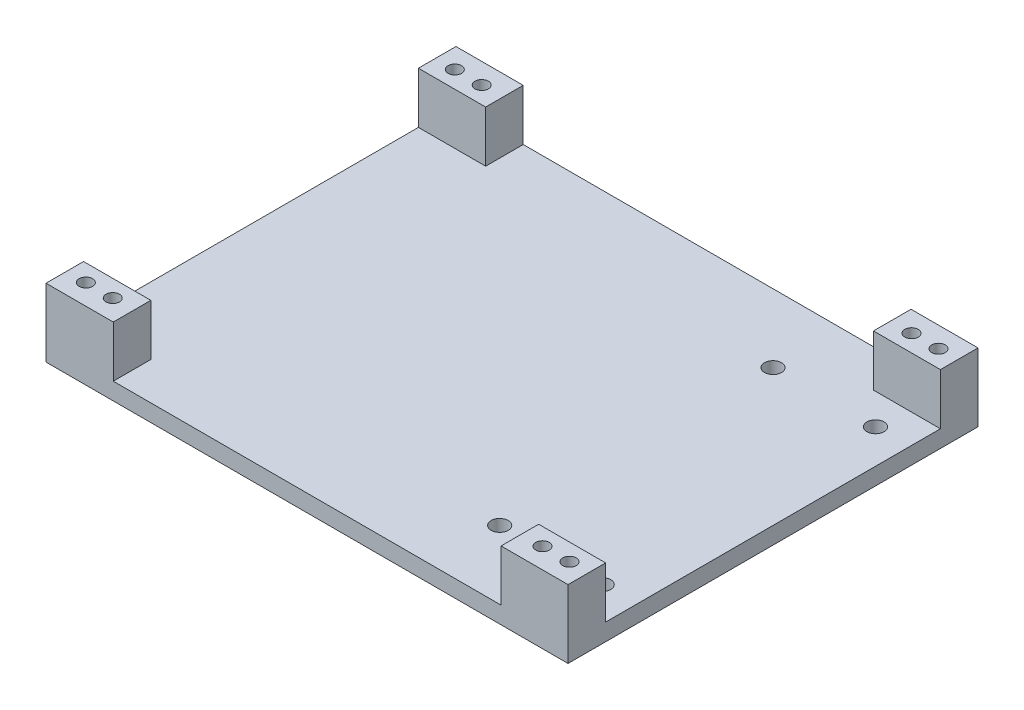
ISO-10303-21;
HEADER;
FILE_DESCRIPTION(('STEP AP214'),'2;1');
FILE_NAME('part.step','',(''),(''),'','','');
FILE_SCHEMA(('AUTOMOTIVE_DESIGN { 1 0 10303 214 1 1 1 1 }'));
ENDSEC;
DATA;
#1=APPLICATION_CONTEXT('core data for automotive mechanical design processes');
#2=APPLICATION_PROTOCOL_DEFINITION('international standard','automotive_design',2000,#1);
#3=PRODUCT_CONTEXT('',#1,'mechanical');
#4=PRODUCT('Part','Part','',(#3));
#5=PRODUCT_RELATED_PRODUCT_CATEGORY('part','',(#4));
#6=PRODUCT_DEFINITION_FORMATION('','',#4);
#7=PRODUCT_DEFINITION_CONTEXT('part definition',#1,'design');
#8=PRODUCT_DEFINITION('design','',#6,#7);
#9=PRODUCT_DEFINITION_SHAPE('','',#8);
#10=(LENGTH_UNIT() NAMED_UNIT(*) SI_UNIT(.MILLI.,.METRE.));
#11=(NAMED_UNIT(*) PLANE_ANGLE_UNIT() SI_UNIT($,.RADIAN.));
#12=(NAMED_UNIT(*) SI_UNIT($,.STERADIAN.) SOLID_ANGLE_UNIT());
#13=UNCERTAINTY_MEASURE_WITH_UNIT(LENGTH_MEASURE(1.E-05),#10,'distance_accuracy_value','');
#14=(GEOMETRIC_REPRESENTATION_CONTEXT(3) GLOBAL_UNCERTAINTY_ASSIGNED_CONTEXT((#13)) GLOBAL_UNIT_ASSIGNED_CONTEXT((#10,
#11,#12)) REPRESENTATION_CONTEXT('',''));
#15=CARTESIAN_POINT('',(0.,0.,0.));
#16=DIRECTION('',(0.,0.,1.));
#17=DIRECTION('',(1.,0.,0.));
#18=AXIS2_PLACEMENT_3D('',#15,#16,#17);
#19=CARTESIAN_POINT('',(0.,6.35,0.));
#20=DIRECTION('',(0.,1.,0.));
#21=DIRECTION('',(0.,0.,1.));
#22=AXIS2_PLACEMENT_3D('',#19,#20,#21);
#23=PLANE('',#22);
#24=CARTESIAN_POINT('',(40.64,6.35,70.4144444444444));
#25=DIRECTION('',(0.,1.,0.));
#26=DIRECTION('',(0.,0.,1.));
#27=AXIS2_PLACEMENT_3D('',#24,#25,#26);
#28=CIRCLE('',#27,3.175);
#29=CARTESIAN_POINT('',(40.64,6.35,73.5894444444444));
#30=VERTEX_POINT('',#29);
#31=EDGE_CURVE('E260',#30,#30,#28,.T.);
#32=ORIENTED_EDGE('',*,*,#31,.F.);
#33=EDGE_LOOP('',(#32));
#34=FACE_BOUND('',#33,.T.);
#35=CARTESIAN_POINT('',(40.64,6.35,-31.1855555555556));
#36=DIRECTION('',(0.,1.,0.));
#37=DIRECTION('',(0.,0.,1.));
#38=AXIS2_PLACEMENT_3D('',#35,#36,#37);
#39=CIRCLE('',#38,3.175);
#40=CARTESIAN_POINT('',(40.64,6.35,-28.0105555555556));
#41=VERTEX_POINT('',#40);
#42=EDGE_CURVE('E271',#41,#41,#39,.T.);
#43=ORIENTED_EDGE('',*,*,#42,.F.);
#44=EDGE_LOOP('',(#43));
#45=FACE_BOUND('',#44,.T.);
#46=CARTESIAN_POINT('',(2.54000000000001,6.35,-31.1855555555556));
#47=DIRECTION('',(0.,1.,0.));
#48=DIRECTION('',(0.,0.,1.));
#49=AXIS2_PLACEMENT_3D('',#46,#47,#48);
#50=CIRCLE('',#49,3.175);
#51=CARTESIAN_POINT('',(2.54000000000001,6.35,-28.0105555555556));
#52=VERTEX_POINT('',#51);
#53=EDGE_CURVE('E265',#52,#52,#50,.T.);
#54=ORIENTED_EDGE('',*,*,#53,.F.);
#55=EDGE_LOOP('',(#54));
#56=FACE_BOUND('',#55,.T.);
#57=CARTESIAN_POINT('',(2.54000000000001,6.35,70.4144444444444));
#58=DIRECTION('',(0.,1.,0.));
#59=DIRECTION('',(0.,0.,1.));
#60=AXIS2_PLACEMENT_3D('',#57,#58,#59);
#61=CIRCLE('',#60,3.175);
#62=CARTESIAN_POINT('',(2.54000000000001,6.35,73.5894444444444));
#63=VERTEX_POINT('',#62);
#64=EDGE_CURVE('E264',#63,#63,#61,.T.);
#65=ORIENTED_EDGE('',*,*,#64,.F.);
#66=EDGE_LOOP('',(#65));
#67=FACE_BOUND('',#66,.T.);
#68=DIRECTION('',(1.,0.,0.));
#69=VECTOR('',#68,1.);
#70=CARTESIAN_POINT('',(53.34,6.35,-42.6155555555556));
#71=LINE('',#70,#69);
#72=CARTESIAN_POINT('',(28.448,6.35,-42.6155555555556));
#73=VERTEX_POINT('',#72);
#74=CARTESIAN_POINT('',(53.34,6.35,-42.6155555555556));
#75=VERTEX_POINT('',#74);
#76=EDGE_CURVE('E48',#73,#75,#71,.T.);
#77=ORIENTED_EDGE('',*,*,#76,.F.);
#78=DIRECTION('',(0.,0.,1.));
#79=VECTOR('',#78,1.);
#80=CARTESIAN_POINT('',(28.448,6.35,-56.5855555555556));
#81=LINE('',#80,#79);
#82=CARTESIAN_POINT('',(28.448,6.35,-56.5855555555556));
#83=VERTEX_POINT('',#82);
#84=EDGE_CURVE('E172',#83,#73,#81,.T.);
#85=ORIENTED_EDGE('',*,*,#84,.F.);
#86=DIRECTION('',(-1.,0.,0.));
#87=VECTOR('',#86,1.);
#88=CARTESIAN_POINT('',(-140.716,6.35,-56.5855555555556));
#89=LINE('',#88,#87);
#90=CARTESIAN_POINT('',(-115.716,6.35,-56.5855555555556));
#91=VERTEX_POINT('',#90);
#92=EDGE_CURVE('E291',#83,#91,#89,.T.);
#93=ORIENTED_EDGE('',*,*,#92,.T.);
#94=DIRECTION('',(0.,0.,-1.));
#95=VECTOR('',#94,1.);
#96=CARTESIAN_POINT('',(-115.716,6.35,-56.5855555555556));
#97=LINE('',#96,#95);
#98=CARTESIAN_POINT('',(-115.716,6.35,-42.6155555555556));
#99=VERTEX_POINT('',#98);
#100=EDGE_CURVE('E193',#99,#91,#97,.T.);
#101=ORIENTED_EDGE('',*,*,#100,.F.);
#102=DIRECTION('',(1.,0.,0.));
#103=VECTOR('',#102,1.);
#104=CARTESIAN_POINT('',(-140.716,6.35,-42.6155555555556));
#105=LINE('',#104,#103);
#106=CARTESIAN_POINT('',(-140.716,6.35,-42.6155555555556));
#107=VERTEX_POINT('',#106);
#108=EDGE_CURVE('E188',#107,#99,#105,.T.);
#109=ORIENTED_EDGE('',*,*,#108,.F.);
#110=DIRECTION('',(0.,0.,1.));
#111=VECTOR('',#110,1.);
#112=CARTESIAN_POINT('',(-140.716,6.35,-56.5855555555556));
#113=LINE('',#112,#111);
#114=CARTESIAN_POINT('',(-140.716,6.35,81.8444444444444));
#115=VERTEX_POINT('',#114);
#116=EDGE_CURVE('E285',#107,#115,#113,.T.);
#117=ORIENTED_EDGE('',*,*,#116,.T.);
#118=DIRECTION('',(-1.,0.,0.));
#119=VECTOR('',#118,1.);
#120=CARTESIAN_POINT('',(-140.716,6.35,81.8444444444444));
#121=LINE('',#120,#119);
#122=CARTESIAN_POINT('',(-115.716,6.35,81.8444444444444));
#123=VERTEX_POINT('',#122);
#124=EDGE_CURVE('E218',#123,#115,#121,.T.);
#125=ORIENTED_EDGE('',*,*,#124,.F.);
#126=DIRECTION('',(0.,0.,-1.));
#127=VECTOR('',#126,1.);
#128=CARTESIAN_POINT('',(-115.716,6.35,95.8144444444444));
#129=LINE('',#128,#127);
#130=CARTESIAN_POINT('',(-115.716,6.35,95.8144444444444));
#131=VERTEX_POINT('',#130);
#132=EDGE_CURVE('E213',#131,#123,#129,.T.);
#133=ORIENTED_EDGE('',*,*,#132,.F.);
#134=DIRECTION('',(1.,0.,0.));
#135=VECTOR('',#134,1.);
#136=CARTESIAN_POINT('',(-140.716,6.35,95.8144444444444));
#137=LINE('',#136,#135);
#138=CARTESIAN_POINT('',(28.448,6.35,95.8144444444444));
#139=VERTEX_POINT('',#138);
#140=EDGE_CURVE('E287',#131,#139,#137,.T.);
#141=ORIENTED_EDGE('',*,*,#140,.T.);
#142=DIRECTION('',(0.,0.,1.));
#143=VECTOR('',#142,1.);
#144=CARTESIAN_POINT('',(28.448,6.35,95.8144444444444));
#145=LINE('',#144,#143);
#146=CARTESIAN_POINT('',(28.448,6.35,81.8444444444444));
#147=VERTEX_POINT('',#146);
#148=EDGE_CURVE('E240',#147,#139,#145,.T.);
#149=ORIENTED_EDGE('',*,*,#148,.F.);
#150=DIRECTION('',(-1.,0.,0.));
#151=VECTOR('',#150,1.);
#152=CARTESIAN_POINT('',(53.34,6.35,81.8444444444444));
#153=LINE('',#152,#151);
#154=CARTESIAN_POINT('',(53.34,6.35,81.8444444444443));
#155=VERTEX_POINT('',#154);
#156=EDGE_CURVE('E235',#155,#147,#153,.T.);
#157=ORIENTED_EDGE('',*,*,#156,.F.);
#158=DIRECTION('',(0.,0.,-1.));
#159=VECTOR('',#158,1.);
#160=CARTESIAN_POINT('',(53.34,6.35,-56.5855555555556));
#161=LINE('',#160,#159);
#162=EDGE_CURVE('E53',#155,#75,#161,.T.);
#163=ORIENTED_EDGE('',*,*,#162,.T.);
#164=EDGE_LOOP('',(#77,#85,#93,#101,#109,#117,#125,#133,#141,#149,#157,#163));
#165=FACE_BOUND('',#164,.T.);
#166=ADVANCED_FACE('F33',(#34,#45,#56,#67,#165),#23,.T.);
#167=CARTESIAN_POINT('',(-140.716,6.35,-56.5855555555556));
#168=DIRECTION('',(1.,0.,0.));
#169=DIRECTION('',(0.,0.,-1.));
#170=AXIS2_PLACEMENT_3D('',#167,#168,#169);
#171=PLANE('',#170);
#172=DIRECTION('',(0.,0.,1.));
#173=VECTOR('',#172,1.);
#174=CARTESIAN_POINT('',(-140.716,0.,-56.5855555555556));
#175=LINE('',#174,#173);
#176=CARTESIAN_POINT('',(-140.716,0.,-56.5855555555556));
#177=VERTEX_POINT('',#176);
#178=CARTESIAN_POINT('',(-140.716,0.,95.8144444444444));
#179=VERTEX_POINT('',#178);
#180=EDGE_CURVE('E282',#177,#179,#175,.T.);
#181=ORIENTED_EDGE('',*,*,#180,.T.);
#182=DIRECTION('',(0.,-1.,0.));
#183=VECTOR('',#182,1.);
#184=CARTESIAN_POINT('',(-140.716,6.35,95.8144444444444));
#185=LINE('',#184,#183);
#186=CARTESIAN_POINT('',(-140.716,25.4,95.8144444444444));
#187=VERTEX_POINT('',#186);
#188=EDGE_CURVE('E11',#187,#179,#185,.T.);
#189=ORIENTED_EDGE('',*,*,#188,.F.);
#190=DIRECTION('',(0.,0.,1.));
#191=VECTOR('',#190,1.);
#192=CARTESIAN_POINT('',(-140.716,25.4,95.8144444444444));
#193=LINE('',#192,#191);
#194=CARTESIAN_POINT('',(-140.716,25.4,81.8444444444444));
#195=VERTEX_POINT('',#194);
#196=EDGE_CURVE('E214',#195,#187,#193,.T.);
#197=ORIENTED_EDGE('',*,*,#196,.F.);
#198=DIRECTION('',(0.,-1.,0.));
#199=VECTOR('',#198,1.);
#200=CARTESIAN_POINT('',(-140.716,25.4,81.8444444444444));
#201=LINE('',#200,#199);
#202=EDGE_CURVE('E224',#195,#115,#201,.T.);
#203=ORIENTED_EDGE('',*,*,#202,.T.);
#204=ORIENTED_EDGE('',*,*,#116,.F.);
#205=DIRECTION('',(0.,-1.,0.));
#206=VECTOR('',#205,1.);
#207=CARTESIAN_POINT('',(-140.716,25.4,-42.6155555555556));
#208=LINE('',#207,#206);
#209=CARTESIAN_POINT('',(-140.716,25.4,-42.6155555555556));
#210=VERTEX_POINT('',#209);
#211=EDGE_CURVE('E210',#210,#107,#208,.T.);
#212=ORIENTED_EDGE('',*,*,#211,.F.);
#213=DIRECTION('',(0.,0.,1.));
#214=VECTOR('',#213,1.);
#215=CARTESIAN_POINT('',(-140.716,25.4,-56.5855555555556));
#216=LINE('',#215,#214);
#217=CARTESIAN_POINT('',(-140.716,25.4,-56.5855555555556));
#218=VERTEX_POINT('',#217);
#219=EDGE_CURVE('E189',#218,#210,#216,.T.);
#220=ORIENTED_EDGE('',*,*,#219,.F.);
#221=DIRECTION('',(0.,-1.,0.));
#222=VECTOR('',#221,1.);
#223=CARTESIAN_POINT('',(-140.716,6.35,-56.5855555555556));
#224=LINE('',#223,#222);
#225=EDGE_CURVE('E156',#218,#177,#224,.T.);
#226=ORIENTED_EDGE('',*,*,#225,.T.);
#227=EDGE_LOOP('',(#181,#189,#197,#203,#204,#212,#220,#226));
#228=FACE_BOUND('',#227,.T.);
#229=ADVANCED_FACE('F35',(#228),#171,.F.);
#230=CARTESIAN_POINT('',(-140.716,6.35,95.8144444444444));
#231=DIRECTION('',(0.,0.,-1.));
#232=DIRECTION('',(-1.,0.,0.));
#233=AXIS2_PLACEMENT_3D('',#230,#231,#232);
#234=PLANE('',#233);
#235=DIRECTION('',(1.,0.,0.));
#236=VECTOR('',#235,1.);
#237=CARTESIAN_POINT('',(-140.716,0.,95.8144444444444));
#238=LINE('',#237,#236);
#239=CARTESIAN_POINT('',(53.34,0.,95.8144444444444));
#240=VERTEX_POINT('',#239);
#241=EDGE_CURVE('E295',#179,#240,#238,.T.);
#242=ORIENTED_EDGE('',*,*,#241,.T.);
#243=DIRECTION('',(0.,-1.,0.));
#244=VECTOR('',#243,1.);
#245=CARTESIAN_POINT('',(53.34,6.35,95.8144444444444));
#246=LINE('',#245,#244);
#247=CARTESIAN_POINT('',(53.34,25.4,95.8144444444444));
#248=VERTEX_POINT('',#247);
#249=EDGE_CURVE('E41',#248,#240,#246,.T.);
#250=ORIENTED_EDGE('',*,*,#249,.F.);
#251=DIRECTION('',(1.,0.,0.));
#252=VECTOR('',#251,1.);
#253=CARTESIAN_POINT('',(53.34,25.4,95.8144444444444));
#254=LINE('',#253,#252);
#255=CARTESIAN_POINT('',(28.448,25.4,95.8144444444444));
#256=VERTEX_POINT('',#255);
#257=EDGE_CURVE('E244',#256,#248,#254,.T.);
#258=ORIENTED_EDGE('',*,*,#257,.F.);
#259=DIRECTION('',(0.,-1.,0.));
#260=VECTOR('',#259,1.);
#261=CARTESIAN_POINT('',(28.448,25.4,95.8144444444444));
#262=LINE('',#261,#260);
#263=EDGE_CURVE('E247',#256,#139,#262,.T.);
#264=ORIENTED_EDGE('',*,*,#263,.T.);
#265=ORIENTED_EDGE('',*,*,#140,.F.);
#266=DIRECTION('',(0.,-1.,0.));
#267=VECTOR('',#266,1.);
#268=CARTESIAN_POINT('',(-115.716,25.4,95.8144444444444));
#269=LINE('',#268,#267);
#270=CARTESIAN_POINT('',(-115.716,25.4,95.8144444444444));
#271=VERTEX_POINT('',#270);
#272=EDGE_CURVE('E233',#271,#131,#269,.T.);
#273=ORIENTED_EDGE('',*,*,#272,.F.);
#274=DIRECTION('',(1.,0.,0.));
#275=VECTOR('',#274,1.);
#276=CARTESIAN_POINT('',(-140.716,25.4,95.8144444444444));
#277=LINE('',#276,#275);
#278=EDGE_CURVE('E217',#187,#271,#277,.T.);
#279=ORIENTED_EDGE('',*,*,#278,.F.);
#280=ORIENTED_EDGE('',*,*,#188,.T.);
#281=EDGE_LOOP('',(#242,#250,#258,#264,#265,#273,#279,#280));
#282=FACE_BOUND('',#281,.T.);
#283=ADVANCED_FACE('F338',(#282),#234,.F.);
#284=CARTESIAN_POINT('',(53.34,6.35,-56.5855555555556));
#285=DIRECTION('',(-1.,0.,0.));
#286=DIRECTION('',(0.,0.,1.));
#287=AXIS2_PLACEMENT_3D('',#284,#285,#286);
#288=PLANE('',#287);
#289=DIRECTION('',(0.,0.,-1.));
#290=VECTOR('',#289,1.);
#291=CARTESIAN_POINT('',(53.34,0.,-56.5855555555556));
#292=LINE('',#291,#290);
#293=CARTESIAN_POINT('',(53.34,0.,-56.5855555555556));
#294=VERTEX_POINT('',#293);
#295=EDGE_CURVE('E153',#240,#294,#292,.T.);
#296=ORIENTED_EDGE('',*,*,#295,.T.);
#297=DIRECTION('',(0.,-1.,0.));
#298=VECTOR('',#297,1.);
#299=CARTESIAN_POINT('',(53.34,6.35,-56.5855555555556));
#300=LINE('',#299,#298);
#301=CARTESIAN_POINT('',(53.34,25.4,-56.5855555555556));
#302=VERTEX_POINT('',#301);
#303=EDGE_CURVE('E145',#302,#294,#300,.T.);
#304=ORIENTED_EDGE('',*,*,#303,.F.);
#305=DIRECTION('',(0.,0.,-1.));
#306=VECTOR('',#305,1.);
#307=CARTESIAN_POINT('',(53.34,25.4,-56.5855555555556));
#308=LINE('',#307,#306);
#309=CARTESIAN_POINT('',(53.34,25.4,-42.6155555555556));
#310=VERTEX_POINT('',#309);
#311=EDGE_CURVE('E150',#310,#302,#308,.T.);
#312=ORIENTED_EDGE('',*,*,#311,.F.);
#313=DIRECTION('',(0.,-1.,0.));
#314=VECTOR('',#313,1.);
#315=CARTESIAN_POINT('',(53.34,25.4,-42.6155555555556));
#316=LINE('',#315,#314);
#317=EDGE_CURVE('E180',#310,#75,#316,.T.);
#318=ORIENTED_EDGE('',*,*,#317,.T.);
#319=ORIENTED_EDGE('',*,*,#162,.F.);
#320=DIRECTION('',(0.,-1.,0.));
#321=VECTOR('',#320,1.);
#322=CARTESIAN_POINT('',(53.34,25.4,81.8444444444444));
#323=LINE('',#322,#321);
#324=CARTESIAN_POINT('',(53.34,25.4,81.8444444444444));
#325=VERTEX_POINT('',#324);
#326=EDGE_CURVE('E257',#325,#155,#323,.T.);
#327=ORIENTED_EDGE('',*,*,#326,.F.);
#328=DIRECTION('',(0.,0.,-1.));
#329=VECTOR('',#328,1.);
#330=CARTESIAN_POINT('',(53.34,25.4,95.8144444444444));
#331=LINE('',#330,#329);
#332=EDGE_CURVE('E236',#248,#325,#331,.T.);
#333=ORIENTED_EDGE('',*,*,#332,.F.);
#334=ORIENTED_EDGE('',*,*,#249,.T.);
#335=EDGE_LOOP('',(#296,#304,#312,#318,#319,#327,#333,#334));
#336=FACE_BOUND('',#335,.T.);
#337=ADVANCED_FACE('F147',(#336),#288,.F.);
#338=CARTESIAN_POINT('',(-140.716,6.35,-56.5855555555556));
#339=DIRECTION('',(0.,0.,1.));
#340=DIRECTION('',(1.,0.,0.));
#341=AXIS2_PLACEMENT_3D('',#338,#339,#340);
#342=PLANE('',#341);
#343=DIRECTION('',(-1.,0.,0.));
#344=VECTOR('',#343,1.);
#345=CARTESIAN_POINT('',(-140.716,0.,-56.5855555555556));
#346=LINE('',#345,#344);
#347=EDGE_CURVE('E288',#294,#177,#346,.T.);
#348=ORIENTED_EDGE('',*,*,#347,.T.);
#349=ORIENTED_EDGE('',*,*,#225,.F.);
#350=DIRECTION('',(-1.,0.,0.));
#351=VECTOR('',#350,1.);
#352=CARTESIAN_POINT('',(-140.716,25.4,-56.5855555555556));
#353=LINE('',#352,#351);
#354=CARTESIAN_POINT('',(-115.716,25.4,-56.5855555555556));
#355=VERTEX_POINT('',#354);
#356=EDGE_CURVE('E197',#355,#218,#353,.T.);
#357=ORIENTED_EDGE('',*,*,#356,.F.);
#358=DIRECTION('',(0.,-1.,0.));
#359=VECTOR('',#358,1.);
#360=CARTESIAN_POINT('',(-115.716,25.4,-56.5855555555556));
#361=LINE('',#360,#359);
#362=EDGE_CURVE('E200',#355,#91,#361,.T.);
#363=ORIENTED_EDGE('',*,*,#362,.T.);
#364=ORIENTED_EDGE('',*,*,#92,.F.);
#365=DIRECTION('',(0.,-1.,0.));
#366=VECTOR('',#365,1.);
#367=CARTESIAN_POINT('',(28.448,25.4,-56.5855555555556));
#368=LINE('',#367,#366);
#369=CARTESIAN_POINT('',(28.448,25.4,-56.5855555555556));
#370=VERTEX_POINT('',#369);
#371=EDGE_CURVE('E162',#370,#83,#368,.T.);
#372=ORIENTED_EDGE('',*,*,#371,.F.);
#373=DIRECTION('',(-1.,0.,0.));
#374=VECTOR('',#373,1.);
#375=CARTESIAN_POINT('',(53.34,25.4,-56.5855555555556));
#376=LINE('',#375,#374);
#377=EDGE_CURVE('E159',#302,#370,#376,.T.);
#378=ORIENTED_EDGE('',*,*,#377,.F.);
#379=ORIENTED_EDGE('',*,*,#303,.T.);
#380=EDGE_LOOP('',(#348,#349,#357,#363,#364,#372,#378,#379));
#381=FACE_BOUND('',#380,.T.);
#382=ADVANCED_FACE('F160',(#381),#342,.F.);
#383=CARTESIAN_POINT('',(0.,0.,0.));
#384=DIRECTION('',(0.,1.,0.));
#385=DIRECTION('',(0.,0.,1.));
#386=AXIS2_PLACEMENT_3D('',#383,#384,#385);
#387=PLANE('',#386);
#388=CARTESIAN_POINT('',(36.258,0.,-48.9655555555556));
#389=DIRECTION('',(0.,1.,0.));
#390=DIRECTION('',(0.,0.,1.));
#391=AXIS2_PLACEMENT_3D('',#388,#389,#390);
#392=CIRCLE('',#391,2.5);
#393=CARTESIAN_POINT('',(36.258,0.,-46.4655555555556));
#394=VERTEX_POINT('',#393);
#395=EDGE_CURVE('E456',#394,#394,#392,.T.);
#396=ORIENTED_EDGE('',*,*,#395,.T.);
#397=EDGE_LOOP('',(#396));
#398=FACE_BOUND('',#397,.T.);
#399=CARTESIAN_POINT('',(-123.526,0.,-48.9655555555556));
#400=DIRECTION('',(0.,1.,0.));
#401=DIRECTION('',(0.,0.,1.));
#402=AXIS2_PLACEMENT_3D('',#399,#400,#401);
#403=CIRCLE('',#402,2.50000000000001);
#404=CARTESIAN_POINT('',(-123.526,0.,-46.4655555555556));
#405=VERTEX_POINT('',#404);
#406=EDGE_CURVE('E449',#405,#405,#403,.T.);
#407=ORIENTED_EDGE('',*,*,#406,.T.);
#408=EDGE_LOOP('',(#407));
#409=FACE_BOUND('',#408,.T.);
#410=CARTESIAN_POINT('',(-133.526,0.,-48.9655555555556));
#411=DIRECTION('',(0.,1.,0.));
#412=DIRECTION('',(0.,0.,1.));
#413=AXIS2_PLACEMENT_3D('',#410,#411,#412);
#414=CIRCLE('',#413,2.5);
#415=CARTESIAN_POINT('',(-133.526,0.,-46.4655555555556));
#416=VERTEX_POINT('',#415);
#417=EDGE_CURVE('E467',#416,#416,#414,.T.);
#418=ORIENTED_EDGE('',*,*,#417,.T.);
#419=EDGE_LOOP('',(#418));
#420=FACE_BOUND('',#419,.T.);
#421=CARTESIAN_POINT('',(-123.526,0.,88.1944444444444));
#422=DIRECTION('',(0.,1.,0.));
#423=DIRECTION('',(0.,0.,1.));
#424=AXIS2_PLACEMENT_3D('',#421,#422,#423);
#425=CIRCLE('',#424,2.50000000000001);
#426=CARTESIAN_POINT('',(-123.526,0.,90.6944444444444));
#427=VERTEX_POINT('',#426);
#428=EDGE_CURVE('E461',#427,#427,#425,.T.);
#429=ORIENTED_EDGE('',*,*,#428,.T.);
#430=EDGE_LOOP('',(#429));
#431=FACE_BOUND('',#430,.T.);
#432=CARTESIAN_POINT('',(46.258,0.,88.1944444444444));
#433=DIRECTION('',(0.,1.,0.));
#434=DIRECTION('',(0.,0.,1.));
#435=AXIS2_PLACEMENT_3D('',#432,#433,#434);
#436=CIRCLE('',#435,2.5);
#437=CARTESIAN_POINT('',(46.258,0.,90.6944444444444));
#438=VERTEX_POINT('',#437);
#439=EDGE_CURVE('E428',#438,#438,#436,.T.);
#440=ORIENTED_EDGE('',*,*,#439,.T.);
#441=EDGE_LOOP('',(#440));
#442=FACE_BOUND('',#441,.T.);
#443=CARTESIAN_POINT('',(36.258,0.,88.1944444444444));
#444=DIRECTION('',(0.,1.,0.));
#445=DIRECTION('',(0.,0.,1.));
#446=AXIS2_PLACEMENT_3D('',#443,#444,#445);
#447=CIRCLE('',#446,2.5);
#448=CARTESIAN_POINT('',(36.258,0.,90.6944444444444));
#449=VERTEX_POINT('',#448);
#450=EDGE_CURVE('E444',#449,#449,#447,.T.);
#451=ORIENTED_EDGE('',*,*,#450,.T.);
#452=EDGE_LOOP('',(#451));
#453=FACE_BOUND('',#452,.T.);
#454=CARTESIAN_POINT('',(46.258,0.,-48.9655555555556));
#455=DIRECTION('',(0.,1.,0.));
#456=DIRECTION('',(0.,0.,1.));
#457=AXIS2_PLACEMENT_3D('',#454,#455,#456);
#458=CIRCLE('',#457,2.5);
#459=CARTESIAN_POINT('',(46.258,0.,-46.4655555555556));
#460=VERTEX_POINT('',#459);
#461=EDGE_CURVE('E437',#460,#460,#458,.T.);
#462=ORIENTED_EDGE('',*,*,#461,.T.);
#463=EDGE_LOOP('',(#462));
#464=FACE_BOUND('',#463,.T.);
#465=CARTESIAN_POINT('',(-133.526,0.,88.1944444444444));
#466=DIRECTION('',(0.,1.,0.));
#467=DIRECTION('',(0.,0.,1.));
#468=AXIS2_PLACEMENT_3D('',#465,#466,#467);
#469=CIRCLE('',#468,2.5);
#470=CARTESIAN_POINT('',(-133.526,0.,90.6944444444444));
#471=VERTEX_POINT('',#470);
#472=EDGE_CURVE('E181',#471,#471,#469,.T.);
#473=ORIENTED_EDGE('',*,*,#472,.T.);
#474=EDGE_LOOP('',(#473));
#475=FACE_BOUND('',#474,.T.);
#476=CARTESIAN_POINT('',(40.64,0.,70.4144444444444));
#477=DIRECTION('',(0.,1.,0.));
#478=DIRECTION('',(0.,0.,1.));
#479=AXIS2_PLACEMENT_3D('',#476,#477,#478);
#480=CIRCLE('',#479,3.175);
#481=CARTESIAN_POINT('',(40.64,0.,73.5894444444444));
#482=VERTEX_POINT('',#481);
#483=EDGE_CURVE('E274',#482,#482,#480,.T.);
#484=ORIENTED_EDGE('',*,*,#483,.T.);
#485=EDGE_LOOP('',(#484));
#486=FACE_BOUND('',#485,.T.);
#487=CARTESIAN_POINT('',(40.64,0.,-31.1855555555556));
#488=DIRECTION('',(0.,1.,0.));
#489=DIRECTION('',(0.,0.,1.));
#490=AXIS2_PLACEMENT_3D('',#487,#488,#489);
#491=CIRCLE('',#490,3.175);
#492=CARTESIAN_POINT('',(40.64,0.,-28.0105555555556));
#493=VERTEX_POINT('',#492);
#494=EDGE_CURVE('E268',#493,#493,#491,.T.);
#495=ORIENTED_EDGE('',*,*,#494,.T.);
#496=EDGE_LOOP('',(#495));
#497=FACE_BOUND('',#496,.T.);
#498=CARTESIAN_POINT('',(2.54000000000001,0.,-31.1855555555556));
#499=DIRECTION('',(0.,1.,0.));
#500=DIRECTION('',(0.,0.,1.));
#501=AXIS2_PLACEMENT_3D('',#498,#499,#500);
#502=CIRCLE('',#501,3.175);
#503=CARTESIAN_POINT('',(2.54000000000001,0.,-28.0105555555556));
#504=VERTEX_POINT('',#503);
#505=EDGE_CURVE('E261',#504,#504,#502,.T.);
#506=ORIENTED_EDGE('',*,*,#505,.T.);
#507=EDGE_LOOP('',(#506));
#508=FACE_BOUND('',#507,.T.);
#509=CARTESIAN_POINT('',(2.54000000000001,0.,70.4144444444444));
#510=DIRECTION('',(0.,1.,0.));
#511=DIRECTION('',(0.,0.,1.));
#512=AXIS2_PLACEMENT_3D('',#509,#510,#511);
#513=CIRCLE('',#512,3.175);
#514=CARTESIAN_POINT('',(2.54000000000001,0.,73.5894444444444));
#515=VERTEX_POINT('',#514);
#516=EDGE_CURVE('E279',#515,#515,#513,.T.);
#517=ORIENTED_EDGE('',*,*,#516,.T.);
#518=EDGE_LOOP('',(#517));
#519=FACE_BOUND('',#518,.T.);
#520=ORIENTED_EDGE('',*,*,#180,.F.);
#521=ORIENTED_EDGE('',*,*,#347,.F.);
#522=ORIENTED_EDGE('',*,*,#295,.F.);
#523=ORIENTED_EDGE('',*,*,#241,.F.);
#524=EDGE_LOOP('',(#520,#521,#522,#523));
#525=FACE_BOUND('',#524,.T.);
#526=ADVANCED_FACE('F306',(#398,#409,#420,#431,#442,#453,#464,#475,#486,#497,#508,#519,#525),
#387,.F.);
#527=CARTESIAN_POINT('',(2.54000000000001,0.,70.4144444444444));
#528=DIRECTION('',(0.,1.,0.));
#529=DIRECTION('',(0.,0.,1.));
#530=AXIS2_PLACEMENT_3D('',#527,#528,#529);
#531=CYLINDRICAL_SURFACE('',#530,3.175);
#532=ORIENTED_EDGE('',*,*,#516,.F.);
#533=EDGE_LOOP('',(#532));
#534=FACE_BOUND('',#533,.T.);
#535=ORIENTED_EDGE('',*,*,#64,.T.);
#536=EDGE_LOOP('',(#535));
#537=FACE_BOUND('',#536,.T.);
#538=ADVANCED_FACE('F343',(#534,#537),#531,.F.);
#539=CARTESIAN_POINT('',(2.54000000000001,0.,-31.1855555555556));
#540=DIRECTION('',(0.,1.,0.));
#541=DIRECTION('',(0.,0.,1.));
#542=AXIS2_PLACEMENT_3D('',#539,#540,#541);
#543=CYLINDRICAL_SURFACE('',#542,3.175);
#544=ORIENTED_EDGE('',*,*,#505,.F.);
#545=EDGE_LOOP('',(#544));
#546=FACE_BOUND('',#545,.T.);
#547=ORIENTED_EDGE('',*,*,#53,.T.);
#548=EDGE_LOOP('',(#547));
#549=FACE_BOUND('',#548,.T.);
#550=ADVANCED_FACE('F489',(#546,#549),#543,.F.);
#551=CARTESIAN_POINT('',(40.64,0.,-31.1855555555556));
#552=DIRECTION('',(0.,1.,0.));
#553=DIRECTION('',(0.,0.,1.));
#554=AXIS2_PLACEMENT_3D('',#551,#552,#553);
#555=CYLINDRICAL_SURFACE('',#554,3.175);
#556=ORIENTED_EDGE('',*,*,#494,.F.);
#557=EDGE_LOOP('',(#556));
#558=FACE_BOUND('',#557,.T.);
#559=ORIENTED_EDGE('',*,*,#42,.T.);
#560=EDGE_LOOP('',(#559));
#561=FACE_BOUND('',#560,.T.);
#562=ADVANCED_FACE('F495',(#558,#561),#555,.F.);
#563=CARTESIAN_POINT('',(40.64,0.,70.4144444444444));
#564=DIRECTION('',(0.,1.,0.));
#565=DIRECTION('',(0.,0.,1.));
#566=AXIS2_PLACEMENT_3D('',#563,#564,#565);
#567=CYLINDRICAL_SURFACE('',#566,3.175);
#568=ORIENTED_EDGE('',*,*,#483,.F.);
#569=EDGE_LOOP('',(#568));
#570=FACE_BOUND('',#569,.T.);
#571=ORIENTED_EDGE('',*,*,#31,.T.);
#572=EDGE_LOOP('',(#571));
#573=FACE_BOUND('',#572,.T.);
#574=ADVANCED_FACE('F501',(#570,#573),#567,.F.);
#575=CARTESIAN_POINT('',(53.34,25.4,81.8444444444444));
#576=DIRECTION('',(0.,0.,1.));
#577=DIRECTION('',(1.,0.,0.));
#578=AXIS2_PLACEMENT_3D('',#575,#576,#577);
#579=PLANE('',#578);
#580=ORIENTED_EDGE('',*,*,#156,.T.);
#581=DIRECTION('',(0.,-1.,0.));
#582=VECTOR('',#581,1.);
#583=CARTESIAN_POINT('',(28.448,25.4,81.8444444444444));
#584=LINE('',#583,#582);
#585=CARTESIAN_POINT('',(28.448,25.4,81.8444444444444));
#586=VERTEX_POINT('',#585);
#587=EDGE_CURVE('E254',#586,#147,#584,.T.);
#588=ORIENTED_EDGE('',*,*,#587,.F.);
#589=DIRECTION('',(-1.,0.,0.));
#590=VECTOR('',#589,1.);
#591=CARTESIAN_POINT('',(53.34,25.4,81.8444444444444));
#592=LINE('',#591,#590);
#593=EDGE_CURVE('E239',#325,#586,#592,.T.);
#594=ORIENTED_EDGE('',*,*,#593,.F.);
#595=ORIENTED_EDGE('',*,*,#326,.T.);
#596=EDGE_LOOP('',(#580,#588,#594,#595));
#597=FACE_BOUND('',#596,.T.);
#598=ADVANCED_FACE('F373',(#597),#579,.F.);
#599=CARTESIAN_POINT('',(28.448,25.4,95.8144444444444));
#600=DIRECTION('',(1.,0.,0.));
#601=DIRECTION('',(0.,0.,-1.));
#602=AXIS2_PLACEMENT_3D('',#599,#600,#601);
#603=PLANE('',#602);
#604=ORIENTED_EDGE('',*,*,#148,.T.);
#605=ORIENTED_EDGE('',*,*,#263,.F.);
#606=DIRECTION('',(0.,0.,1.));
#607=VECTOR('',#606,1.);
#608=CARTESIAN_POINT('',(28.448,25.4,95.8144444444444));
#609=LINE('',#608,#607);
#610=EDGE_CURVE('E242',#586,#256,#609,.T.);
#611=ORIENTED_EDGE('',*,*,#610,.F.);
#612=ORIENTED_EDGE('',*,*,#587,.T.);
#613=EDGE_LOOP('',(#604,#605,#611,#612));
#614=FACE_BOUND('',#613,.T.);
#615=ADVANCED_FACE('F370',(#614),#603,.F.);
#616=CARTESIAN_POINT('',(0.,25.4,0.));
#617=DIRECTION('',(0.,1.,0.));
#618=DIRECTION('',(0.,0.,1.));
#619=AXIS2_PLACEMENT_3D('',#616,#617,#618);
#620=PLANE('',#619);
#621=CARTESIAN_POINT('',(46.258,25.4,88.1944444444444));
#622=DIRECTION('',(0.,1.,0.));
#623=DIRECTION('',(0.,0.,1.));
#624=AXIS2_PLACEMENT_3D('',#621,#622,#623);
#625=CIRCLE('',#624,2.5);
#626=CARTESIAN_POINT('',(46.258,25.4,90.6944444444444));
#627=VERTEX_POINT('',#626);
#628=EDGE_CURVE('E431',#627,#627,#625,.T.);
#629=ORIENTED_EDGE('',*,*,#628,.F.);
#630=EDGE_LOOP('',(#629));
#631=FACE_BOUND('',#630,.T.);
#632=CARTESIAN_POINT('',(36.258,25.4,88.1944444444444));
#633=DIRECTION('',(0.,1.,0.));
#634=DIRECTION('',(0.,0.,1.));
#635=AXIS2_PLACEMENT_3D('',#632,#633,#634);
#636=CIRCLE('',#635,2.5);
#637=CARTESIAN_POINT('',(36.258,25.4,90.6944444444444));
#638=VERTEX_POINT('',#637);
#639=EDGE_CURVE('E434',#638,#638,#636,.T.);
#640=ORIENTED_EDGE('',*,*,#639,.F.);
#641=EDGE_LOOP('',(#640));
#642=FACE_BOUND('',#641,.T.);
#643=ORIENTED_EDGE('',*,*,#332,.T.);
#644=ORIENTED_EDGE('',*,*,#593,.T.);
#645=ORIENTED_EDGE('',*,*,#610,.T.);
#646=ORIENTED_EDGE('',*,*,#257,.T.);
#647=EDGE_LOOP('',(#643,#644,#645,#646));
#648=FACE_BOUND('',#647,.T.);
#649=ADVANCED_FACE('F516',(#631,#642,#648),#620,.T.);
#650=CARTESIAN_POINT('',(-115.716,25.4,95.8144444444444));
#651=DIRECTION('',(-1.,0.,0.));
#652=DIRECTION('',(0.,0.,1.));
#653=AXIS2_PLACEMENT_3D('',#650,#651,#652);
#654=PLANE('',#653);
#655=ORIENTED_EDGE('',*,*,#132,.T.);
#656=DIRECTION('',(0.,-1.,0.));
#657=VECTOR('',#656,1.);
#658=CARTESIAN_POINT('',(-115.716,25.4,81.8444444444444));
#659=LINE('',#658,#657);
#660=CARTESIAN_POINT('',(-115.716,25.4,81.8444444444444));
#661=VERTEX_POINT('',#660);
#662=EDGE_CURVE('E231',#661,#123,#659,.T.);
#663=ORIENTED_EDGE('',*,*,#662,.F.);
#664=DIRECTION('',(0.,0.,-1.));
#665=VECTOR('',#664,1.);
#666=CARTESIAN_POINT('',(-115.716,25.4,95.8144444444444));
#667=LINE('',#666,#665);
#668=EDGE_CURVE('E220',#271,#661,#667,.T.);
#669=ORIENTED_EDGE('',*,*,#668,.F.);
#670=ORIENTED_EDGE('',*,*,#272,.T.);
#671=EDGE_LOOP('',(#655,#663,#669,#670));
#672=FACE_BOUND('',#671,.T.);
#673=ADVANCED_FACE('F520',(#672),#654,.F.);
#674=CARTESIAN_POINT('',(-140.716,25.4,81.8444444444444));
#675=DIRECTION('',(0.,0.,1.));
#676=DIRECTION('',(1.,0.,0.));
#677=AXIS2_PLACEMENT_3D('',#674,#675,#676);
#678=PLANE('',#677);
#679=ORIENTED_EDGE('',*,*,#124,.T.);
#680=ORIENTED_EDGE('',*,*,#202,.F.);
#681=DIRECTION('',(-1.,0.,0.));
#682=VECTOR('',#681,1.);
#683=CARTESIAN_POINT('',(-140.716,25.4,81.8444444444444));
#684=LINE('',#683,#682);
#685=EDGE_CURVE('E222',#661,#195,#684,.T.);
#686=ORIENTED_EDGE('',*,*,#685,.F.);
#687=ORIENTED_EDGE('',*,*,#662,.T.);
#688=EDGE_LOOP('',(#679,#680,#686,#687));
#689=FACE_BOUND('',#688,.T.);
#690=ADVANCED_FACE('F329',(#689),#678,.F.);
#691=CARTESIAN_POINT('',(0.,25.4,0.));
#692=DIRECTION('',(0.,-1.,0.));
#693=DIRECTION('',(0.,0.,-1.));
#694=AXIS2_PLACEMENT_3D('',#691,#692,#693);
#695=PLANE('',#694);
#696=CARTESIAN_POINT('',(-123.526,25.4,88.1944444444444));
#697=DIRECTION('',(0.,1.,0.));
#698=DIRECTION('',(0.,0.,1.));
#699=AXIS2_PLACEMENT_3D('',#696,#697,#698);
#700=CIRCLE('',#699,2.50000000000001);
#701=CARTESIAN_POINT('',(-123.526,25.4,90.6944444444444));
#702=VERTEX_POINT('',#701);
#703=EDGE_CURVE('E464',#702,#702,#700,.T.);
#704=ORIENTED_EDGE('',*,*,#703,.F.);
#705=EDGE_LOOP('',(#704));
#706=FACE_BOUND('',#705,.T.);
#707=CARTESIAN_POINT('',(-133.526,25.4,88.1944444444444));
#708=DIRECTION('',(0.,1.,0.));
#709=DIRECTION('',(0.,0.,1.));
#710=AXIS2_PLACEMENT_3D('',#707,#708,#709);
#711=CIRCLE('',#710,2.5);
#712=CARTESIAN_POINT('',(-133.526,25.4,90.6944444444444));
#713=VERTEX_POINT('',#712);
#714=EDGE_CURVE('E175',#713,#713,#711,.T.);
#715=ORIENTED_EDGE('',*,*,#714,.F.);
#716=EDGE_LOOP('',(#715));
#717=FACE_BOUND('',#716,.T.);
#718=ORIENTED_EDGE('',*,*,#196,.T.);
#719=ORIENTED_EDGE('',*,*,#278,.T.);
#720=ORIENTED_EDGE('',*,*,#668,.T.);
#721=ORIENTED_EDGE('',*,*,#685,.T.);
#722=EDGE_LOOP('',(#718,#719,#720,#721));
#723=FACE_BOUND('',#722,.T.);
#724=ADVANCED_FACE('F322',(#706,#717,#723),#695,.F.);
#725=CARTESIAN_POINT('',(-140.716,25.4,-42.6155555555556));
#726=DIRECTION('',(0.,0.,-1.));
#727=DIRECTION('',(-1.,0.,0.));
#728=AXIS2_PLACEMENT_3D('',#725,#726,#727);
#729=PLANE('',#728);
#730=ORIENTED_EDGE('',*,*,#108,.T.);
#731=DIRECTION('',(0.,-1.,0.));
#732=VECTOR('',#731,1.);
#733=CARTESIAN_POINT('',(-115.716,25.4,-42.6155555555556));
#734=LINE('',#733,#732);
#735=CARTESIAN_POINT('',(-115.716,25.4,-42.6155555555556));
#736=VERTEX_POINT('',#735);
#737=EDGE_CURVE('E207',#736,#99,#734,.T.);
#738=ORIENTED_EDGE('',*,*,#737,.F.);
#739=DIRECTION('',(1.,0.,0.));
#740=VECTOR('',#739,1.);
#741=CARTESIAN_POINT('',(-140.716,25.4,-42.6155555555556));
#742=LINE('',#741,#740);
#743=EDGE_CURVE('E192',#210,#736,#742,.T.);
#744=ORIENTED_EDGE('',*,*,#743,.F.);
#745=ORIENTED_EDGE('',*,*,#211,.T.);
#746=EDGE_LOOP('',(#730,#738,#744,#745));
#747=FACE_BOUND('',#746,.T.);
#748=ADVANCED_FACE('F320',(#747),#729,.F.);
#749=CARTESIAN_POINT('',(-115.716,25.4,-56.5855555555556));
#750=DIRECTION('',(-1.,0.,0.));
#751=DIRECTION('',(0.,0.,1.));
#752=AXIS2_PLACEMENT_3D('',#749,#750,#751);
#753=PLANE('',#752);
#754=ORIENTED_EDGE('',*,*,#100,.T.);
#755=ORIENTED_EDGE('',*,*,#362,.F.);
#756=DIRECTION('',(0.,0.,-1.));
#757=VECTOR('',#756,1.);
#758=CARTESIAN_POINT('',(-115.716,25.4,-56.5855555555556));
#759=LINE('',#758,#757);
#760=EDGE_CURVE('E195',#736,#355,#759,.T.);
#761=ORIENTED_EDGE('',*,*,#760,.F.);
#762=ORIENTED_EDGE('',*,*,#737,.T.);
#763=EDGE_LOOP('',(#754,#755,#761,#762));
#764=FACE_BOUND('',#763,.T.);
#765=ADVANCED_FACE('F318',(#764),#753,.F.);
#766=CARTESIAN_POINT('',(0.,25.4,0.));
#767=DIRECTION('',(0.,1.,0.));
#768=DIRECTION('',(0.,0.,1.));
#769=AXIS2_PLACEMENT_3D('',#766,#767,#768);
#770=PLANE('',#769);
#771=CARTESIAN_POINT('',(-123.526,25.4,-48.9655555555556));
#772=DIRECTION('',(0.,1.,0.));
#773=DIRECTION('',(0.,0.,1.));
#774=AXIS2_PLACEMENT_3D('',#771,#772,#773);
#775=CIRCLE('',#774,2.50000000000001);
#776=CARTESIAN_POINT('',(-123.526,25.4,-46.4655555555556));
#777=VERTEX_POINT('',#776);
#778=EDGE_CURVE('E453',#777,#777,#775,.T.);
#779=ORIENTED_EDGE('',*,*,#778,.F.);
#780=EDGE_LOOP('',(#779));
#781=FACE_BOUND('',#780,.T.);
#782=CARTESIAN_POINT('',(-133.526,25.4,-48.9655555555556));
#783=DIRECTION('',(0.,1.,0.));
#784=DIRECTION('',(0.,0.,1.));
#785=AXIS2_PLACEMENT_3D('',#782,#783,#784);
#786=CIRCLE('',#785,2.5);
#787=CARTESIAN_POINT('',(-133.526,25.4,-46.4655555555556));
#788=VERTEX_POINT('',#787);
#789=EDGE_CURVE('E452',#788,#788,#786,.T.);
#790=ORIENTED_EDGE('',*,*,#789,.F.);
#791=EDGE_LOOP('',(#790));
#792=FACE_BOUND('',#791,.T.);
#793=ORIENTED_EDGE('',*,*,#219,.T.);
#794=ORIENTED_EDGE('',*,*,#743,.T.);
#795=ORIENTED_EDGE('',*,*,#760,.T.);
#796=ORIENTED_EDGE('',*,*,#356,.T.);
#797=EDGE_LOOP('',(#793,#794,#795,#796));
#798=FACE_BOUND('',#797,.T.);
#799=ADVANCED_FACE('F313',(#781,#792,#798),#770,.T.);
#800=CARTESIAN_POINT('',(28.448,25.4,-56.5855555555556));
#801=DIRECTION('',(1.,0.,0.));
#802=DIRECTION('',(0.,0.,-1.));
#803=AXIS2_PLACEMENT_3D('',#800,#801,#802);
#804=PLANE('',#803);
#805=ORIENTED_EDGE('',*,*,#84,.T.);
#806=DIRECTION('',(0.,-1.,0.));
#807=VECTOR('',#806,1.);
#808=CARTESIAN_POINT('',(28.448,25.4,-42.6155555555556));
#809=LINE('',#808,#807);
#810=CARTESIAN_POINT('',(28.448,25.4,-42.6155555555556));
#811=VERTEX_POINT('',#810);
#812=EDGE_CURVE('E184',#811,#73,#809,.T.);
#813=ORIENTED_EDGE('',*,*,#812,.F.);
#814=DIRECTION('',(0.,0.,1.));
#815=VECTOR('',#814,1.);
#816=CARTESIAN_POINT('',(28.448,25.4,-56.5855555555556));
#817=LINE('',#816,#815);
#818=EDGE_CURVE('E165',#370,#811,#817,.T.);
#819=ORIENTED_EDGE('',*,*,#818,.F.);
#820=ORIENTED_EDGE('',*,*,#371,.T.);
#821=EDGE_LOOP('',(#805,#813,#819,#820));
#822=FACE_BOUND('',#821,.T.);
#823=ADVANCED_FACE('F378',(#822),#804,.F.);
#824=CARTESIAN_POINT('',(53.34,25.4,-42.6155555555556));
#825=DIRECTION('',(0.,0.,-1.));
#826=DIRECTION('',(-1.,0.,0.));
#827=AXIS2_PLACEMENT_3D('',#824,#825,#826);
#828=PLANE('',#827);
#829=ORIENTED_EDGE('',*,*,#76,.T.);
#830=ORIENTED_EDGE('',*,*,#317,.F.);
#831=DIRECTION('',(1.,0.,0.));
#832=VECTOR('',#831,1.);
#833=CARTESIAN_POINT('',(53.34,25.4,-42.6155555555556));
#834=LINE('',#833,#832);
#835=EDGE_CURVE('E169',#811,#310,#834,.T.);
#836=ORIENTED_EDGE('',*,*,#835,.F.);
#837=ORIENTED_EDGE('',*,*,#812,.T.);
#838=EDGE_LOOP('',(#829,#830,#836,#837));
#839=FACE_BOUND('',#838,.T.);
#840=ADVANCED_FACE('F375',(#839),#828,.F.);
#841=CARTESIAN_POINT('',(0.,25.4,0.));
#842=DIRECTION('',(0.,-1.,0.));
#843=DIRECTION('',(0.,0.,-1.));
#844=AXIS2_PLACEMENT_3D('',#841,#842,#843);
#845=PLANE('',#844);
#846=CARTESIAN_POINT('',(36.258,25.4,-48.9655555555556));
#847=DIRECTION('',(0.,1.,0.));
#848=DIRECTION('',(0.,0.,1.));
#849=AXIS2_PLACEMENT_3D('',#846,#847,#848);
#850=CIRCLE('',#849,2.5);
#851=CARTESIAN_POINT('',(36.258,25.4,-46.4655555555556));
#852=VERTEX_POINT('',#851);
#853=EDGE_CURVE('E440',#852,#852,#850,.T.);
#854=ORIENTED_EDGE('',*,*,#853,.F.);
#855=EDGE_LOOP('',(#854));
#856=FACE_BOUND('',#855,.T.);
#857=CARTESIAN_POINT('',(46.258,25.4,-48.9655555555556));
#858=DIRECTION('',(0.,1.,0.));
#859=DIRECTION('',(0.,0.,1.));
#860=AXIS2_PLACEMENT_3D('',#857,#858,#859);
#861=CIRCLE('',#860,2.5);
#862=CARTESIAN_POINT('',(46.258,25.4,-46.4655555555556));
#863=VERTEX_POINT('',#862);
#864=EDGE_CURVE('E441',#863,#863,#861,.T.);
#865=ORIENTED_EDGE('',*,*,#864,.F.);
#866=EDGE_LOOP('',(#865));
#867=FACE_BOUND('',#866,.T.);
#868=ORIENTED_EDGE('',*,*,#311,.T.);
#869=ORIENTED_EDGE('',*,*,#377,.T.);
#870=ORIENTED_EDGE('',*,*,#818,.T.);
#871=ORIENTED_EDGE('',*,*,#835,.T.);
#872=EDGE_LOOP('',(#868,#869,#870,#871));
#873=FACE_BOUND('',#872,.T.);
#874=ADVANCED_FACE('F167',(#856,#867,#873),#845,.F.);
#875=CARTESIAN_POINT('',(46.258,0.,-48.9655555555556));
#876=DIRECTION('',(0.,1.,0.));
#877=DIRECTION('',(0.,0.,1.));
#878=AXIS2_PLACEMENT_3D('',#875,#876,#877);
#879=CYLINDRICAL_SURFACE('',#878,2.5);
#880=ORIENTED_EDGE('',*,*,#461,.F.);
#881=EDGE_LOOP('',(#880));
#882=FACE_BOUND('',#881,.T.);
#883=ORIENTED_EDGE('',*,*,#864,.T.);
#884=EDGE_LOOP('',(#883));
#885=FACE_BOUND('',#884,.T.);
#886=ADVANCED_FACE('F391',(#882,#885),#879,.F.);
#887=CARTESIAN_POINT('',(36.258,0.,-48.9655555555556));
#888=DIRECTION('',(0.,1.,0.));
#889=DIRECTION('',(0.,0.,1.));
#890=AXIS2_PLACEMENT_3D('',#887,#888,#889);
#891=CYLINDRICAL_SURFACE('',#890,2.5);
#892=ORIENTED_EDGE('',*,*,#395,.F.);
#893=EDGE_LOOP('',(#892));
#894=FACE_BOUND('',#893,.T.);
#895=ORIENTED_EDGE('',*,*,#853,.T.);
#896=EDGE_LOOP('',(#895));
#897=FACE_BOUND('',#896,.T.);
#898=ADVANCED_FACE('F402',(#894,#897),#891,.F.);
#899=CARTESIAN_POINT('',(-133.526,0.,-48.9655555555556));
#900=DIRECTION('',(0.,1.,0.));
#901=DIRECTION('',(0.,0.,1.));
#902=AXIS2_PLACEMENT_3D('',#899,#900,#901);
#903=CYLINDRICAL_SURFACE('',#902,2.5);
#904=ORIENTED_EDGE('',*,*,#417,.F.);
#905=EDGE_LOOP('',(#904));
#906=FACE_BOUND('',#905,.T.);
#907=ORIENTED_EDGE('',*,*,#789,.T.);
#908=EDGE_LOOP('',(#907));
#909=FACE_BOUND('',#908,.T.);
#910=ADVANCED_FACE('F399',(#906,#909),#903,.F.);
#911=CARTESIAN_POINT('',(-123.526,0.,-48.9655555555556));
#912=DIRECTION('',(0.,1.,0.));
#913=DIRECTION('',(0.,0.,1.));
#914=AXIS2_PLACEMENT_3D('',#911,#912,#913);
#915=CYLINDRICAL_SURFACE('',#914,2.50000000000001);
#916=ORIENTED_EDGE('',*,*,#406,.F.);
#917=EDGE_LOOP('',(#916));
#918=FACE_BOUND('',#917,.T.);
#919=ORIENTED_EDGE('',*,*,#778,.T.);
#920=EDGE_LOOP('',(#919));
#921=FACE_BOUND('',#920,.T.);
#922=ADVANCED_FACE('F397',(#918,#921),#915,.F.);
#923=CARTESIAN_POINT('',(-133.526,0.,88.1944444444444));
#924=DIRECTION('',(0.,1.,0.));
#925=DIRECTION('',(0.,0.,1.));
#926=AXIS2_PLACEMENT_3D('',#923,#924,#925);
#927=CYLINDRICAL_SURFACE('',#926,2.5);
#928=ORIENTED_EDGE('',*,*,#472,.F.);
#929=EDGE_LOOP('',(#928));
#930=FACE_BOUND('',#929,.T.);
#931=ORIENTED_EDGE('',*,*,#714,.T.);
#932=EDGE_LOOP('',(#931));
#933=FACE_BOUND('',#932,.T.);
#934=ADVANCED_FACE('F393',(#930,#933),#927,.F.);
#935=CARTESIAN_POINT('',(-123.526,0.,88.1944444444444));
#936=DIRECTION('',(0.,1.,0.));
#937=DIRECTION('',(0.,0.,1.));
#938=AXIS2_PLACEMENT_3D('',#935,#936,#937);
#939=CYLINDRICAL_SURFACE('',#938,2.50000000000001);
#940=ORIENTED_EDGE('',*,*,#428,.F.);
#941=EDGE_LOOP('',(#940));
#942=FACE_BOUND('',#941,.T.);
#943=ORIENTED_EDGE('',*,*,#703,.T.);
#944=EDGE_LOOP('',(#943));
#945=FACE_BOUND('',#944,.T.);
#946=ADVANCED_FACE('F396',(#942,#945),#939,.F.);
#947=CARTESIAN_POINT('',(36.258,0.,88.1944444444444));
#948=DIRECTION('',(0.,1.,0.));
#949=DIRECTION('',(0.,0.,1.));
#950=AXIS2_PLACEMENT_3D('',#947,#948,#949);
#951=CYLINDRICAL_SURFACE('',#950,2.5);
#952=ORIENTED_EDGE('',*,*,#450,.F.);
#953=EDGE_LOOP('',(#952));
#954=FACE_BOUND('',#953,.T.);
#955=ORIENTED_EDGE('',*,*,#639,.T.);
#956=EDGE_LOOP('',(#955));
#957=FACE_BOUND('',#956,.T.);
#958=ADVANCED_FACE('F406',(#954,#957),#951,.F.);
#959=CARTESIAN_POINT('',(46.258,0.,88.1944444444444));
#960=DIRECTION('',(0.,1.,0.));
#961=DIRECTION('',(0.,0.,1.));
#962=AXIS2_PLACEMENT_3D('',#959,#960,#961);
#963=CYLINDRICAL_SURFACE('',#962,2.5);
#964=ORIENTED_EDGE('',*,*,#439,.F.);
#965=EDGE_LOOP('',(#964));
#966=FACE_BOUND('',#965,.T.);
#967=ORIENTED_EDGE('',*,*,#628,.T.);
#968=EDGE_LOOP('',(#967));
#969=FACE_BOUND('',#968,.T.);
#970=ADVANCED_FACE('F416',(#966,#969),#963,.F.);
#971=CLOSED_SHELL('',(#166,#229,#283,#337,#382,#526,#538,#550,#562,#574,#598,#615,#649,#673,
#690,#724,#748,#765,#799,#823,#840,#874,#886,#898,#910,#922,#934,#946,#958,#970));
#972=MANIFOLD_SOLID_BREP('B2',#971);
#973=ADVANCED_BREP_SHAPE_REPRESENTATION('',(#18,#972),#14);
#974=SHAPE_DEFINITION_REPRESENTATION(#9,#973);
ENDSEC;
END-ISO-10303-21;
